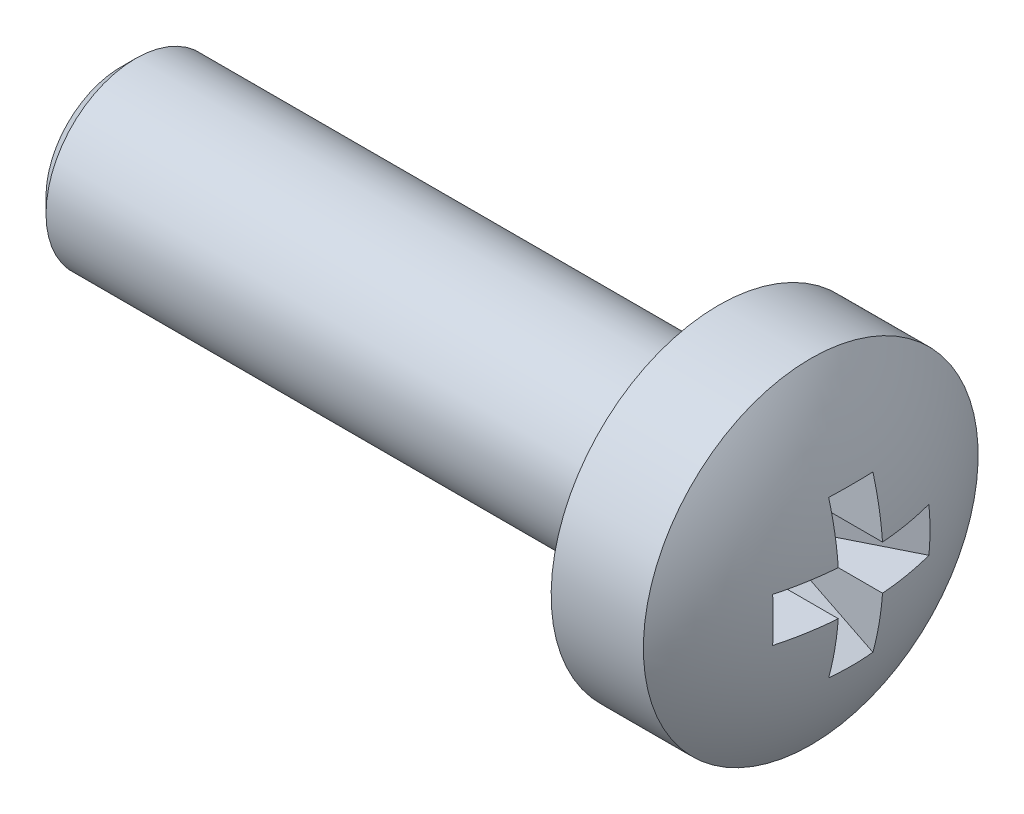
ISO-10303-21;
HEADER;
FILE_DESCRIPTION(('STEP AP214'),'2;1');
FILE_NAME('part.step','',(''),(''),'','','');
FILE_SCHEMA(('AUTOMOTIVE_DESIGN { 1 0 10303 214 1 1 1 1 }'));
ENDSEC;
DATA;
#1=APPLICATION_CONTEXT('core data for automotive mechanical design processes');
#2=APPLICATION_PROTOCOL_DEFINITION('international standard','automotive_design',2000,#1);
#3=PRODUCT_CONTEXT('',#1,'mechanical');
#4=PRODUCT('Part','Part','',(#3));
#5=PRODUCT_RELATED_PRODUCT_CATEGORY('part','',(#4));
#6=PRODUCT_DEFINITION_FORMATION('','',#4);
#7=PRODUCT_DEFINITION_CONTEXT('part definition',#1,'design');
#8=PRODUCT_DEFINITION('design','',#6,#7);
#9=PRODUCT_DEFINITION_SHAPE('','',#8);
#10=(LENGTH_UNIT() NAMED_UNIT(*) SI_UNIT(.MILLI.,.METRE.));
#11=(NAMED_UNIT(*) PLANE_ANGLE_UNIT() SI_UNIT($,.RADIAN.));
#12=(NAMED_UNIT(*) SI_UNIT($,.STERADIAN.) SOLID_ANGLE_UNIT());
#13=UNCERTAINTY_MEASURE_WITH_UNIT(LENGTH_MEASURE(1.E-05),#10,'distance_accuracy_value','');
#14=(GEOMETRIC_REPRESENTATION_CONTEXT(3) GLOBAL_UNCERTAINTY_ASSIGNED_CONTEXT((#13)) GLOBAL_UNIT_ASSIGNED_CONTEXT((#10,
#11,#12)) REPRESENTATION_CONTEXT('',''));
#15=CARTESIAN_POINT('',(0.,0.,0.));
#16=DIRECTION('',(0.,0.,1.));
#17=DIRECTION('',(1.,0.,0.));
#18=AXIS2_PLACEMENT_3D('',#15,#16,#17);
#19=CARTESIAN_POINT('',(-5.,0.,0.));
#20=DIRECTION('',(1.,0.,0.));
#21=DIRECTION('',(0.,-1.,0.));
#22=AXIS2_PLACEMENT_3D('',#19,#20,#21);
#23=SPHERICAL_SURFACE('',#22,5.);
#24=CARTESIAN_POINT('',(-4.56358241491322,0.,-0.875318258911803));
#25=DIRECTION('',(0.446197813109809,0.,-0.894934361602025));
#26=DIRECTION('',(-0.894934361602025,0.,-0.446197813109809));
#27=AXIS2_PLACEMENT_3D('',#24,#25,#26);
#28=CIRCLE('',#27,4.90340265907692);
#29=CARTESIAN_POINT('',(-0.187869730483241,0.37,1.3063316076711));
#30=VERTEX_POINT('',#29);
#31=CARTESIAN_POINT('',(-0.187869730483241,-0.37,1.3063316076711));
#32=VERTEX_POINT('',#31);
#33=EDGE_CURVE('E195',#30,#32,#28,.T.);
#34=ORIENTED_EDGE('',*,*,#33,.F.);
#35=CARTESIAN_POINT('',(-5.,0.37,0.));
#36=DIRECTION('',(0.,-1.,0.));
#37=DIRECTION('',(0.,0.,-1.));
#38=AXIS2_PLACEMENT_3D('',#35,#36,#37);
#39=CIRCLE('',#38,4.98629120689917);
#40=CARTESIAN_POINT('',(-0.0274553797879303,0.37,0.37));
#41=VERTEX_POINT('',#40);
#42=EDGE_CURVE('E114',#30,#41,#39,.F.);
#43=ORIENTED_EDGE('',*,*,#42,.T.);
#44=CARTESIAN_POINT('',(-5.,0.,0.37));
#45=DIRECTION('',(0.,0.,1.));
#46=DIRECTION('',(0.,-1.,0.));
#47=AXIS2_PLACEMENT_3D('',#44,#45,#46);
#48=CIRCLE('',#47,4.98629120689917);
#49=CARTESIAN_POINT('',(-0.187869730483241,1.3063316076711,0.37));
#50=VERTEX_POINT('',#49);
#51=EDGE_CURVE('E146',#50,#41,#48,.F.);
#52=ORIENTED_EDGE('',*,*,#51,.F.);
#53=CARTESIAN_POINT('',(-4.56358241491322,-0.875318258911803,0.));
#54=DIRECTION('',(0.446197813109809,-0.894934361602025,0.));
#55=DIRECTION('',(0.894934361602025,0.446197813109809,0.));
#56=AXIS2_PLACEMENT_3D('',#53,#54,#55);
#57=CIRCLE('',#56,4.90340265907692);
#58=CARTESIAN_POINT('',(-0.187869730483241,1.3063316076711,-0.37));
#59=VERTEX_POINT('',#58);
#60=EDGE_CURVE('E143',#50,#59,#57,.F.);
#61=ORIENTED_EDGE('',*,*,#60,.T.);
#62=CARTESIAN_POINT('',(-5.,0.,-0.37));
#63=DIRECTION('',(0.,0.,1.));
#64=DIRECTION('',(0.,-1.,0.));
#65=AXIS2_PLACEMENT_3D('',#62,#63,#64);
#66=CIRCLE('',#65,4.98629120689917);
#67=CARTESIAN_POINT('',(-0.0274553797879303,0.37,-0.37));
#68=VERTEX_POINT('',#67);
#69=EDGE_CURVE('E147',#59,#68,#66,.F.);
#70=ORIENTED_EDGE('',*,*,#69,.T.);
#71=CARTESIAN_POINT('',(-5.,0.37,0.));
#72=DIRECTION('',(0.,-1.,0.));
#73=DIRECTION('',(0.,0.,-1.));
#74=AXIS2_PLACEMENT_3D('',#71,#72,#73);
#75=CIRCLE('',#74,4.98629120689917);
#76=CARTESIAN_POINT('',(-0.187869730483241,0.37,-1.3063316076711));
#77=VERTEX_POINT('',#76);
#78=EDGE_CURVE('E197',#68,#77,#75,.F.);
#79=ORIENTED_EDGE('',*,*,#78,.T.);
#80=CARTESIAN_POINT('',(-4.56358241491322,0.,0.875318258911803));
#81=DIRECTION('',(0.446197813109809,0.,0.894934361602025));
#82=DIRECTION('',(0.894934361602025,0.,-0.446197813109809));
#83=AXIS2_PLACEMENT_3D('',#80,#81,#82);
#84=CIRCLE('',#83,4.90340265907692);
#85=CARTESIAN_POINT('',(-0.187869730483241,-0.37,-1.3063316076711));
#86=VERTEX_POINT('',#85);
#87=EDGE_CURVE('E200',#77,#86,#84,.F.);
#88=ORIENTED_EDGE('',*,*,#87,.T.);
#89=CARTESIAN_POINT('',(-5.,-0.37,0.));
#90=DIRECTION('',(0.,-1.,0.));
#91=DIRECTION('',(0.,0.,-1.));
#92=AXIS2_PLACEMENT_3D('',#89,#90,#91);
#93=CIRCLE('',#92,4.98629120689917);
#94=CARTESIAN_POINT('',(-0.0274553797879303,-0.37,-0.37));
#95=VERTEX_POINT('',#94);
#96=EDGE_CURVE('E201',#95,#86,#93,.F.);
#97=ORIENTED_EDGE('',*,*,#96,.F.);
#98=CARTESIAN_POINT('',(-5.,0.,-0.37));
#99=DIRECTION('',(0.,0.,1.));
#100=DIRECTION('',(0.,-1.,0.));
#101=AXIS2_PLACEMENT_3D('',#98,#99,#100);
#102=CIRCLE('',#101,4.98629120689917);
#103=CARTESIAN_POINT('',(-0.187869730483241,-1.3063316076711,-0.37));
#104=VERTEX_POINT('',#103);
#105=EDGE_CURVE('E157',#95,#104,#102,.F.);
#106=ORIENTED_EDGE('',*,*,#105,.T.);
#107=CARTESIAN_POINT('',(-4.56358241491322,0.875318258911802,0.));
#108=DIRECTION('',(0.446197813109809,0.894934361602025,0.));
#109=DIRECTION('',(-0.894934361602025,0.446197813109809,0.));
#110=AXIS2_PLACEMENT_3D('',#107,#108,#109);
#111=CIRCLE('',#110,4.90340265907692);
#112=CARTESIAN_POINT('',(-0.187869730483241,-1.3063316076711,0.37));
#113=VERTEX_POINT('',#112);
#114=EDGE_CURVE('E154',#113,#104,#111,.T.);
#115=ORIENTED_EDGE('',*,*,#114,.F.);
#116=CARTESIAN_POINT('',(-5.,0.,0.37));
#117=DIRECTION('',(0.,0.,1.));
#118=DIRECTION('',(0.,-1.,0.));
#119=AXIS2_PLACEMENT_3D('',#116,#117,#118);
#120=CIRCLE('',#119,4.98629120689917);
#121=CARTESIAN_POINT('',(-0.0274553797879303,-0.37,0.37));
#122=VERTEX_POINT('',#121);
#123=EDGE_CURVE('E158',#122,#113,#120,.F.);
#124=ORIENTED_EDGE('',*,*,#123,.F.);
#125=CARTESIAN_POINT('',(-5.,-0.37,0.));
#126=DIRECTION('',(0.,-1.,0.));
#127=DIRECTION('',(0.,0.,-1.));
#128=AXIS2_PLACEMENT_3D('',#125,#126,#127);
#129=CIRCLE('',#128,4.98629120689917);
#130=EDGE_CURVE('E193',#32,#122,#129,.F.);
#131=ORIENTED_EDGE('',*,*,#130,.F.);
#132=EDGE_LOOP('',(#34,#43,#52,#61,#70,#79,#88,#97,#106,#115,#124,#131));
#133=FACE_BOUND('',#132,.T.);
#134=CARTESIAN_POINT('',(-0.857536964558404,0.,0.));
#135=DIRECTION('',(1.,0.,0.));
#136=DIRECTION('',(0.,1.,0.));
#137=AXIS2_PLACEMENT_3D('',#134,#135,#136);
#138=CIRCLE('',#137,2.8);
#139=CARTESIAN_POINT('',(-0.857536964558404,2.8,0.));
#140=VERTEX_POINT('',#139);
#141=EDGE_CURVE('E118',#140,#140,#138,.T.);
#142=ORIENTED_EDGE('',*,*,#141,.T.);
#143=EDGE_LOOP('',(#142));
#144=FACE_BOUND('',#143,.T.);
#145=ADVANCED_FACE('F16',(#133,#144),#23,.T.);
#146=CARTESIAN_POINT('',(-12.4,0.,0.));
#147=DIRECTION('',(-1.,0.,0.));
#148=DIRECTION('',(0.,-1.,0.));
#149=AXIS2_PLACEMENT_3D('',#146,#147,#148);
#150=PLANE('',#149);
#151=CARTESIAN_POINT('',(-12.4,0.,0.));
#152=DIRECTION('',(-1.,0.,0.));
#153=DIRECTION('',(0.,-1.,0.));
#154=AXIS2_PLACEMENT_3D('',#151,#152,#153);
#155=CIRCLE('',#154,1.25);
#156=CARTESIAN_POINT('',(-12.4,-1.25,0.));
#157=VERTEX_POINT('',#156);
#158=EDGE_CURVE('E10',#157,#157,#155,.T.);
#159=ORIENTED_EDGE('',*,*,#158,.T.);
#160=EDGE_LOOP('',(#159));
#161=FACE_BOUND('',#160,.T.);
#162=ADVANCED_FACE('F262',(#161),#150,.T.);
#163=CARTESIAN_POINT('',(0.,0.,0.));
#164=DIRECTION('',(1.,0.,0.));
#165=DIRECTION('',(0.,1.,0.));
#166=AXIS2_PLACEMENT_3D('',#163,#164,#165);
#167=CYLINDRICAL_SURFACE('',#166,1.5);
#168=CARTESIAN_POINT('',(-12.15,0.,0.));
#169=DIRECTION('',(-1.,0.,0.));
#170=DIRECTION('',(0.,-1.,0.));
#171=AXIS2_PLACEMENT_3D('',#168,#169,#170);
#172=CIRCLE('',#171,1.5);
#173=CARTESIAN_POINT('',(-12.15,-1.5,0.));
#174=VERTEX_POINT('',#173);
#175=EDGE_CURVE('E26',#174,#174,#172,.F.);
#176=ORIENTED_EDGE('',*,*,#175,.T.);
#177=EDGE_LOOP('',(#176));
#178=FACE_BOUND('',#177,.T.);
#179=CARTESIAN_POINT('',(-2.4,0.,0.));
#180=DIRECTION('',(1.,0.,0.));
#181=DIRECTION('',(0.,1.,0.));
#182=AXIS2_PLACEMENT_3D('',#179,#180,#181);
#183=CIRCLE('',#182,1.5);
#184=CARTESIAN_POINT('',(-2.4,1.5,0.));
#185=VERTEX_POINT('',#184);
#186=EDGE_CURVE('E190',#185,#185,#183,.T.);
#187=ORIENTED_EDGE('',*,*,#186,.F.);
#188=EDGE_LOOP('',(#187));
#189=FACE_BOUND('',#188,.T.);
#190=ADVANCED_FACE('F268',(#178,#189),#167,.T.);
#191=CARTESIAN_POINT('',(-2.4,1.5,0.));
#192=DIRECTION('',(-1.,0.,0.));
#193=DIRECTION('',(0.,-1.,0.));
#194=AXIS2_PLACEMENT_3D('',#191,#192,#193);
#195=PLANE('',#194);
#196=ORIENTED_EDGE('',*,*,#186,.T.);
#197=EDGE_LOOP('',(#196));
#198=FACE_BOUND('',#197,.T.);
#199=CARTESIAN_POINT('',(-2.4,0.,0.));
#200=DIRECTION('',(1.,0.,0.));
#201=DIRECTION('',(0.,1.,0.));
#202=AXIS2_PLACEMENT_3D('',#199,#200,#201);
#203=CIRCLE('',#202,2.8);
#204=CARTESIAN_POINT('',(-2.4,2.8,0.));
#205=VERTEX_POINT('',#204);
#206=EDGE_CURVE('E187',#205,#205,#203,.T.);
#207=ORIENTED_EDGE('',*,*,#206,.F.);
#208=EDGE_LOOP('',(#207));
#209=FACE_BOUND('',#208,.T.);
#210=ADVANCED_FACE('F299',(#198,#209),#195,.T.);
#211=CARTESIAN_POINT('',(0.,0.,0.));
#212=DIRECTION('',(1.,0.,0.));
#213=DIRECTION('',(0.,1.,0.));
#214=AXIS2_PLACEMENT_3D('',#211,#212,#213);
#215=CYLINDRICAL_SURFACE('',#214,2.8);
#216=ORIENTED_EDGE('',*,*,#206,.T.);
#217=EDGE_LOOP('',(#216));
#218=FACE_BOUND('',#217,.T.);
#219=ORIENTED_EDGE('',*,*,#141,.F.);
#220=EDGE_LOOP('',(#219));
#221=FACE_BOUND('',#220,.T.);
#222=ADVANCED_FACE('F296',(#218,#221),#215,.T.);
#223=CARTESIAN_POINT('',(0.,0.,1.4));
#224=DIRECTION('',(0.446197813109809,0.,-0.894934361602025));
#225=DIRECTION('',(-0.894934361602025,0.,-0.446197813109809));
#226=AXIS2_PLACEMENT_3D('',#223,#224,#225);
#227=PLANE('',#226);
#228=ORIENTED_EDGE('',*,*,#33,.T.);
#229=DIRECTION('',(-0.894934361602025,0.,-0.446197813109809));
#230=VECTOR('',#229,1.);
#231=CARTESIAN_POINT('',(0.,-0.37,1.4));
#232=LINE('',#231,#230);
#233=CARTESIAN_POINT('',(-1.75,-0.37,0.527482185906493));
#234=VERTEX_POINT('',#233);
#235=EDGE_CURVE('E35',#234,#32,#232,.F.);
#236=ORIENTED_EDGE('',*,*,#235,.F.);
#237=DIRECTION('',(0.,1.,0.));
#238=VECTOR('',#237,1.);
#239=CARTESIAN_POINT('',(-1.75,0.,0.527482185906493));
#240=LINE('',#239,#238);
#241=CARTESIAN_POINT('',(-1.75,0.37,0.527482185906493));
#242=VERTEX_POINT('',#241);
#243=EDGE_CURVE('E126',#242,#234,#240,.F.);
#244=ORIENTED_EDGE('',*,*,#243,.F.);
#245=DIRECTION('',(-0.894934361602025,0.,-0.446197813109809));
#246=VECTOR('',#245,1.);
#247=CARTESIAN_POINT('',(0.,0.37,1.4));
#248=LINE('',#247,#246);
#249=EDGE_CURVE('E107',#242,#30,#248,.F.);
#250=ORIENTED_EDGE('',*,*,#249,.T.);
#251=EDGE_LOOP('',(#228,#236,#244,#250));
#252=FACE_BOUND('',#251,.T.);
#253=ADVANCED_FACE('F18',(#252),#227,.T.);
#254=CARTESIAN_POINT('',(-1.75,0.37,0.));
#255=DIRECTION('',(0.,-1.,0.));
#256=DIRECTION('',(0.,0.,-1.));
#257=AXIS2_PLACEMENT_3D('',#254,#255,#256);
#258=PLANE('',#257);
#259=ORIENTED_EDGE('',*,*,#249,.F.);
#260=DIRECTION('',(0.,0.,-1.));
#261=VECTOR('',#260,1.);
#262=CARTESIAN_POINT('',(-1.75,0.37,0.));
#263=LINE('',#262,#261);
#264=CARTESIAN_POINT('',(-1.75,0.37,0.37));
#265=VERTEX_POINT('',#264);
#266=EDGE_CURVE('E111',#242,#265,#263,.T.);
#267=ORIENTED_EDGE('',*,*,#266,.T.);
#268=DIRECTION('',(1.,0.,0.));
#269=VECTOR('',#268,1.);
#270=CARTESIAN_POINT('',(-1.75,0.37,0.37));
#271=LINE('',#270,#269);
#272=EDGE_CURVE('E119',#265,#41,#271,.T.);
#273=ORIENTED_EDGE('',*,*,#272,.T.);
#274=ORIENTED_EDGE('',*,*,#42,.F.);
#275=EDGE_LOOP('',(#259,#267,#273,#274));
#276=FACE_BOUND('',#275,.T.);
#277=ADVANCED_FACE('F109',(#276),#258,.T.);
#278=CARTESIAN_POINT('',(-1.75,0.,0.37));
#279=DIRECTION('',(0.,0.,1.));
#280=DIRECTION('',(0.,-1.,0.));
#281=AXIS2_PLACEMENT_3D('',#278,#279,#280);
#282=PLANE('',#281);
#283=ORIENTED_EDGE('',*,*,#51,.T.);
#284=ORIENTED_EDGE('',*,*,#272,.F.);
#285=DIRECTION('',(0.,-1.,0.));
#286=VECTOR('',#285,1.);
#287=CARTESIAN_POINT('',(-1.75,0.,0.37));
#288=LINE('',#287,#286);
#289=CARTESIAN_POINT('',(-1.75,0.527482185906492,0.37));
#290=VERTEX_POINT('',#289);
#291=EDGE_CURVE('E129',#290,#265,#288,.T.);
#292=ORIENTED_EDGE('',*,*,#291,.F.);
#293=DIRECTION('',(0.894934361602025,0.446197813109809,0.));
#294=VECTOR('',#293,1.);
#295=CARTESIAN_POINT('',(-1.96063300229114,0.42246444491505,0.37));
#296=LINE('',#295,#294);
#297=EDGE_CURVE('E139',#290,#50,#296,.T.);
#298=ORIENTED_EDGE('',*,*,#297,.T.);
#299=EDGE_LOOP('',(#283,#284,#292,#298));
#300=FACE_BOUND('',#299,.T.);
#301=ADVANCED_FACE('F250',(#300),#282,.F.);
#302=CARTESIAN_POINT('',(0.,1.4,0.));
#303=DIRECTION('',(0.446197813109809,-0.894934361602025,0.));
#304=DIRECTION('',(0.894934361602025,0.446197813109809,0.));
#305=AXIS2_PLACEMENT_3D('',#302,#303,#304);
#306=PLANE('',#305);
#307=ORIENTED_EDGE('',*,*,#297,.F.);
#308=DIRECTION('',(0.,0.,-1.));
#309=VECTOR('',#308,1.);
#310=CARTESIAN_POINT('',(-1.75,0.527482185906492,0.));
#311=LINE('',#310,#309);
#312=CARTESIAN_POINT('',(-1.75,0.527482185906492,-0.37));
#313=VERTEX_POINT('',#312);
#314=EDGE_CURVE('E151',#290,#313,#311,.T.);
#315=ORIENTED_EDGE('',*,*,#314,.T.);
#316=DIRECTION('',(0.894934361602025,0.446197813109809,0.));
#317=VECTOR('',#316,1.);
#318=CARTESIAN_POINT('',(-1.96063300229114,0.42246444491505,-0.37));
#319=LINE('',#318,#317);
#320=EDGE_CURVE('E142',#313,#59,#319,.T.);
#321=ORIENTED_EDGE('',*,*,#320,.T.);
#322=ORIENTED_EDGE('',*,*,#60,.F.);
#323=EDGE_LOOP('',(#307,#315,#321,#322));
#324=FACE_BOUND('',#323,.T.);
#325=ADVANCED_FACE('F248',(#324),#306,.T.);
#326=CARTESIAN_POINT('',(-1.75,0.,-0.37));
#327=DIRECTION('',(0.,0.,1.));
#328=DIRECTION('',(0.,-1.,0.));
#329=AXIS2_PLACEMENT_3D('',#326,#327,#328);
#330=PLANE('',#329);
#331=ORIENTED_EDGE('',*,*,#320,.F.);
#332=DIRECTION('',(0.,-1.,0.));
#333=VECTOR('',#332,1.);
#334=CARTESIAN_POINT('',(-1.75,0.,-0.37));
#335=LINE('',#334,#333);
#336=CARTESIAN_POINT('',(-1.75,0.37,-0.37));
#337=VERTEX_POINT('',#336);
#338=EDGE_CURVE('E153',#313,#337,#335,.T.);
#339=ORIENTED_EDGE('',*,*,#338,.T.);
#340=DIRECTION('',(1.,0.,0.));
#341=VECTOR('',#340,1.);
#342=CARTESIAN_POINT('',(-1.75,0.37,-0.37));
#343=LINE('',#342,#341);
#344=EDGE_CURVE('E150',#337,#68,#343,.T.);
#345=ORIENTED_EDGE('',*,*,#344,.T.);
#346=ORIENTED_EDGE('',*,*,#69,.F.);
#347=EDGE_LOOP('',(#331,#339,#345,#346));
#348=FACE_BOUND('',#347,.T.);
#349=ADVANCED_FACE('F245',(#348),#330,.T.);
#350=CARTESIAN_POINT('',(-1.75,0.37,0.));
#351=DIRECTION('',(0.,-1.,0.));
#352=DIRECTION('',(0.,0.,-1.));
#353=AXIS2_PLACEMENT_3D('',#350,#351,#352);
#354=PLANE('',#353);
#355=ORIENTED_EDGE('',*,*,#344,.F.);
#356=DIRECTION('',(0.,0.,-1.));
#357=VECTOR('',#356,1.);
#358=CARTESIAN_POINT('',(-1.75,0.37,0.));
#359=LINE('',#358,#357);
#360=CARTESIAN_POINT('',(-1.75,0.37,-0.527482185906493));
#361=VERTEX_POINT('',#360);
#362=EDGE_CURVE('E173',#337,#361,#359,.T.);
#363=ORIENTED_EDGE('',*,*,#362,.T.);
#364=DIRECTION('',(0.894934361602025,0.,-0.446197813109809));
#365=VECTOR('',#364,1.);
#366=CARTESIAN_POINT('',(0.,0.37,-1.4));
#367=LINE('',#366,#365);
#368=EDGE_CURVE('E180',#361,#77,#367,.T.);
#369=ORIENTED_EDGE('',*,*,#368,.T.);
#370=ORIENTED_EDGE('',*,*,#78,.F.);
#371=EDGE_LOOP('',(#355,#363,#369,#370));
#372=FACE_BOUND('',#371,.T.);
#373=ADVANCED_FACE('F242',(#372),#354,.T.);
#374=CARTESIAN_POINT('',(0.,0.,-1.4));
#375=DIRECTION('',(0.446197813109809,0.,0.894934361602025));
#376=DIRECTION('',(0.894934361602025,0.,-0.446197813109809));
#377=AXIS2_PLACEMENT_3D('',#374,#375,#376);
#378=PLANE('',#377);
#379=ORIENTED_EDGE('',*,*,#368,.F.);
#380=DIRECTION('',(0.,-1.,0.));
#381=VECTOR('',#380,1.);
#382=CARTESIAN_POINT('',(-1.75,0.,-0.527482185906493));
#383=LINE('',#382,#381);
#384=CARTESIAN_POINT('',(-1.75,-0.37,-0.527482185906493));
#385=VERTEX_POINT('',#384);
#386=EDGE_CURVE('E172',#361,#385,#383,.T.);
#387=ORIENTED_EDGE('',*,*,#386,.T.);
#388=DIRECTION('',(0.894934361602025,0.,-0.446197813109809));
#389=VECTOR('',#388,1.);
#390=CARTESIAN_POINT('',(0.,-0.37,-1.4));
#391=LINE('',#390,#389);
#392=EDGE_CURVE('E182',#385,#86,#391,.T.);
#393=ORIENTED_EDGE('',*,*,#392,.T.);
#394=ORIENTED_EDGE('',*,*,#87,.F.);
#395=EDGE_LOOP('',(#379,#387,#393,#394));
#396=FACE_BOUND('',#395,.T.);
#397=ADVANCED_FACE('F236',(#396),#378,.T.);
#398=CARTESIAN_POINT('',(-1.75,-0.37,0.));
#399=DIRECTION('',(0.,-1.,0.));
#400=DIRECTION('',(0.,0.,-1.));
#401=AXIS2_PLACEMENT_3D('',#398,#399,#400);
#402=PLANE('',#401);
#403=ORIENTED_EDGE('',*,*,#96,.T.);
#404=ORIENTED_EDGE('',*,*,#392,.F.);
#405=DIRECTION('',(0.,0.,-1.));
#406=VECTOR('',#405,1.);
#407=CARTESIAN_POINT('',(-1.75,-0.37,0.));
#408=LINE('',#407,#406);
#409=CARTESIAN_POINT('',(-1.75,-0.37,-0.37));
#410=VERTEX_POINT('',#409);
#411=EDGE_CURVE('E165',#410,#385,#408,.T.);
#412=ORIENTED_EDGE('',*,*,#411,.F.);
#413=DIRECTION('',(1.,0.,0.));
#414=VECTOR('',#413,1.);
#415=CARTESIAN_POINT('',(-1.75,-0.37,-0.37));
#416=LINE('',#415,#414);
#417=EDGE_CURVE('E79',#410,#95,#416,.T.);
#418=ORIENTED_EDGE('',*,*,#417,.T.);
#419=EDGE_LOOP('',(#403,#404,#412,#418));
#420=FACE_BOUND('',#419,.T.);
#421=ADVANCED_FACE('F232',(#420),#402,.F.);
#422=CARTESIAN_POINT('',(-1.75,0.,-0.37));
#423=DIRECTION('',(0.,0.,1.));
#424=DIRECTION('',(0.,-1.,0.));
#425=AXIS2_PLACEMENT_3D('',#422,#423,#424);
#426=PLANE('',#425);
#427=ORIENTED_EDGE('',*,*,#417,.F.);
#428=DIRECTION('',(0.,-1.,0.));
#429=VECTOR('',#428,1.);
#430=CARTESIAN_POINT('',(-1.75,0.,-0.37));
#431=LINE('',#430,#429);
#432=CARTESIAN_POINT('',(-1.75,-0.527482185906493,-0.37));
#433=VERTEX_POINT('',#432);
#434=EDGE_CURVE('E73',#410,#433,#431,.T.);
#435=ORIENTED_EDGE('',*,*,#434,.T.);
#436=DIRECTION('',(-0.894934361602025,0.446197813109809,0.));
#437=VECTOR('',#436,1.);
#438=CARTESIAN_POINT('',(-1.96063300229114,-0.42246444491505,-0.37));
#439=LINE('',#438,#437);
#440=EDGE_CURVE('E20',#433,#104,#439,.F.);
#441=ORIENTED_EDGE('',*,*,#440,.T.);
#442=ORIENTED_EDGE('',*,*,#105,.F.);
#443=EDGE_LOOP('',(#427,#435,#441,#442));
#444=FACE_BOUND('',#443,.T.);
#445=ADVANCED_FACE('F228',(#444),#426,.T.);
#446=CARTESIAN_POINT('',(0.,-1.4,0.));
#447=DIRECTION('',(0.446197813109809,0.894934361602025,0.));
#448=DIRECTION('',(-0.894934361602025,0.446197813109809,0.));
#449=AXIS2_PLACEMENT_3D('',#446,#447,#448);
#450=PLANE('',#449);
#451=ORIENTED_EDGE('',*,*,#114,.T.);
#452=ORIENTED_EDGE('',*,*,#440,.F.);
#453=DIRECTION('',(0.,0.,1.));
#454=VECTOR('',#453,1.);
#455=CARTESIAN_POINT('',(-1.75,-0.527482185906493,0.));
#456=LINE('',#455,#454);
#457=CARTESIAN_POINT('',(-1.75,-0.527482185906493,0.37));
#458=VERTEX_POINT('',#457);
#459=EDGE_CURVE('E161',#458,#433,#456,.F.);
#460=ORIENTED_EDGE('',*,*,#459,.F.);
#461=DIRECTION('',(-0.894934361602025,0.446197813109809,0.));
#462=VECTOR('',#461,1.);
#463=CARTESIAN_POINT('',(-1.96063300229114,-0.42246444491505,0.37));
#464=LINE('',#463,#462);
#465=EDGE_CURVE('E159',#458,#113,#464,.F.);
#466=ORIENTED_EDGE('',*,*,#465,.T.);
#467=EDGE_LOOP('',(#451,#452,#460,#466));
#468=FACE_BOUND('',#467,.T.);
#469=ADVANCED_FACE('F227',(#468),#450,.T.);
#470=CARTESIAN_POINT('',(-1.75,0.,0.37));
#471=DIRECTION('',(0.,0.,1.));
#472=DIRECTION('',(0.,-1.,0.));
#473=AXIS2_PLACEMENT_3D('',#470,#471,#472);
#474=PLANE('',#473);
#475=ORIENTED_EDGE('',*,*,#123,.T.);
#476=ORIENTED_EDGE('',*,*,#465,.F.);
#477=DIRECTION('',(0.,-1.,0.));
#478=VECTOR('',#477,1.);
#479=CARTESIAN_POINT('',(-1.75,0.,0.37));
#480=LINE('',#479,#478);
#481=CARTESIAN_POINT('',(-1.75,-0.37,0.37));
#482=VERTEX_POINT('',#481);
#483=EDGE_CURVE('E133',#482,#458,#480,.T.);
#484=ORIENTED_EDGE('',*,*,#483,.F.);
#485=DIRECTION('',(1.,0.,0.));
#486=VECTOR('',#485,1.);
#487=CARTESIAN_POINT('',(-1.75,-0.37,0.37));
#488=LINE('',#487,#486);
#489=EDGE_CURVE('E138',#482,#122,#488,.T.);
#490=ORIENTED_EDGE('',*,*,#489,.T.);
#491=EDGE_LOOP('',(#475,#476,#484,#490));
#492=FACE_BOUND('',#491,.T.);
#493=ADVANCED_FACE('F225',(#492),#474,.F.);
#494=CARTESIAN_POINT('',(-1.75,-0.37,0.));
#495=DIRECTION('',(0.,-1.,0.));
#496=DIRECTION('',(0.,0.,-1.));
#497=AXIS2_PLACEMENT_3D('',#494,#495,#496);
#498=PLANE('',#497);
#499=ORIENTED_EDGE('',*,*,#130,.T.);
#500=ORIENTED_EDGE('',*,*,#489,.F.);
#501=DIRECTION('',(0.,0.,-1.));
#502=VECTOR('',#501,1.);
#503=CARTESIAN_POINT('',(-1.75,-0.37,0.));
#504=LINE('',#503,#502);
#505=EDGE_CURVE('E131',#234,#482,#504,.T.);
#506=ORIENTED_EDGE('',*,*,#505,.F.);
#507=ORIENTED_EDGE('',*,*,#235,.T.);
#508=EDGE_LOOP('',(#499,#500,#506,#507));
#509=FACE_BOUND('',#508,.T.);
#510=ADVANCED_FACE('F223',(#509),#498,.F.);
#511=CARTESIAN_POINT('',(-1.75,0.,0.));
#512=DIRECTION('',(1.,0.,0.));
#513=DIRECTION('',(0.,0.,-1.));
#514=AXIS2_PLACEMENT_3D('',#511,#512,#513);
#515=PLANE('',#514);
#516=ORIENTED_EDGE('',*,*,#243,.T.);
#517=ORIENTED_EDGE('',*,*,#505,.T.);
#518=ORIENTED_EDGE('',*,*,#483,.T.);
#519=ORIENTED_EDGE('',*,*,#459,.T.);
#520=ORIENTED_EDGE('',*,*,#434,.F.);
#521=ORIENTED_EDGE('',*,*,#411,.T.);
#522=ORIENTED_EDGE('',*,*,#386,.F.);
#523=ORIENTED_EDGE('',*,*,#362,.F.);
#524=ORIENTED_EDGE('',*,*,#338,.F.);
#525=ORIENTED_EDGE('',*,*,#314,.F.);
#526=ORIENTED_EDGE('',*,*,#291,.T.);
#527=ORIENTED_EDGE('',*,*,#266,.F.);
#528=EDGE_LOOP('',(#516,#517,#518,#519,#520,#521,#522,#523,#524,#525,#526,#527));
#529=FACE_BOUND('',#528,.T.);
#530=ADVANCED_FACE('F124',(#529),#515,.T.);
#531=CARTESIAN_POINT('',(-12.15,0.,0.));
#532=DIRECTION('',(1.,0.,0.));
#533=DIRECTION('',(0.,1.,0.));
#534=AXIS2_PLACEMENT_3D('',#531,#532,#533);
#535=CONICAL_SURFACE('',#534,1.5,0.785398163397446);
#536=ORIENTED_EDGE('',*,*,#158,.F.);
#537=EDGE_LOOP('',(#536));
#538=FACE_BOUND('',#537,.T.);
#539=ORIENTED_EDGE('',*,*,#175,.F.);
#540=EDGE_LOOP('',(#539));
#541=FACE_BOUND('',#540,.T.);
#542=ADVANCED_FACE('F273',(#538,#541),#535,.T.);
#543=CLOSED_SHELL('',(#145,#162,#190,#210,#222,#253,#277,#301,#325,#349,#373,#397,#421,#445,
#469,#493,#510,#530,#542));
#544=MANIFOLD_SOLID_BREP('B1',#543);
#545=ADVANCED_BREP_SHAPE_REPRESENTATION('',(#18,#544),#14);
#546=SHAPE_DEFINITION_REPRESENTATION(#9,#545);
ENDSEC;
END-ISO-10303-21;
